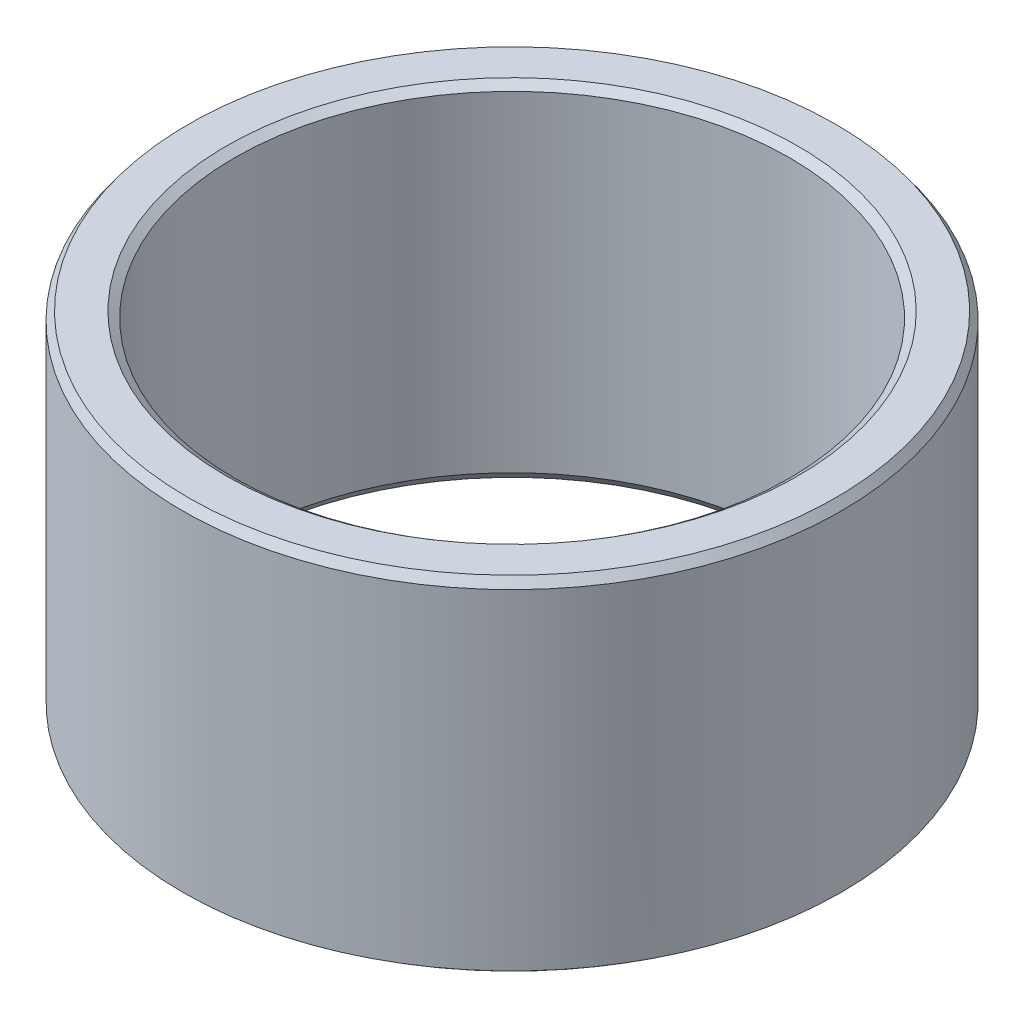
ISO-10303-21;
HEADER;
FILE_DESCRIPTION(('STEP AP214'),'2;1');
FILE_NAME('part.step','',(''),(''),'','','');
FILE_SCHEMA(('AUTOMOTIVE_DESIGN { 1 0 10303 214 1 1 1 1 }'));
ENDSEC;
DATA;
#1=APPLICATION_CONTEXT('core data for automotive mechanical design processes');
#2=APPLICATION_PROTOCOL_DEFINITION('international standard','automotive_design',2000,#1);
#3=PRODUCT_CONTEXT('',#1,'mechanical');
#4=PRODUCT('Part','Part','',(#3));
#5=PRODUCT_RELATED_PRODUCT_CATEGORY('part','',(#4));
#6=PRODUCT_DEFINITION_FORMATION('','',#4);
#7=PRODUCT_DEFINITION_CONTEXT('part definition',#1,'design');
#8=PRODUCT_DEFINITION('design','',#6,#7);
#9=PRODUCT_DEFINITION_SHAPE('','',#8);
#10=(LENGTH_UNIT() NAMED_UNIT(*) SI_UNIT(.MILLI.,.METRE.));
#11=(NAMED_UNIT(*) PLANE_ANGLE_UNIT() SI_UNIT($,.RADIAN.));
#12=(NAMED_UNIT(*) SI_UNIT($,.STERADIAN.) SOLID_ANGLE_UNIT());
#13=UNCERTAINTY_MEASURE_WITH_UNIT(LENGTH_MEASURE(1.E-05),#10,'distance_accuracy_value','');
#14=(GEOMETRIC_REPRESENTATION_CONTEXT(3) GLOBAL_UNCERTAINTY_ASSIGNED_CONTEXT((#13)) GLOBAL_UNIT_ASSIGNED_CONTEXT((#10,
#11,#12)) REPRESENTATION_CONTEXT('',''));
#15=CARTESIAN_POINT('',(0.,0.,0.));
#16=DIRECTION('',(0.,0.,1.));
#17=DIRECTION('',(1.,0.,0.));
#18=AXIS2_PLACEMENT_3D('',#15,#16,#17);
#19=CARTESIAN_POINT('',(0.,23.5215551141102,0.));
#20=DIRECTION('',(0.,-1.,0.));
#21=DIRECTION('',(0.,0.,-1.));
#22=AXIS2_PLACEMENT_3D('',#19,#20,#21);
#23=CYLINDRICAL_SURFACE('',#22,22.5);
#24=CARTESIAN_POINT('',(0.,0.409436889821459,0.));
#25=DIRECTION('',(0.,1.,0.));
#26=DIRECTION('',(0.,0.,1.));
#27=AXIS2_PLACEMENT_3D('',#24,#25,#26);
#28=CIRCLE('',#27,22.5);
#29=CARTESIAN_POINT('',(0.,0.409436889821455,-22.5));
#30=VERTEX_POINT('',#29);
#31=EDGE_CURVE('E10',#30,#30,#28,.T.);
#32=CARTESIAN_POINT('',(0.,22.956294201715,0.));
#33=DIRECTION('',(0.,1.,0.));
#34=DIRECTION('',(0.,0.,1.));
#35=AXIS2_PLACEMENT_3D('',#32,#33,#34);
#36=CIRCLE('',#35,22.5);
#37=CARTESIAN_POINT('',(0.,22.956294201715,-22.5));
#38=VERTEX_POINT('',#37);
#39=EDGE_CURVE('E50',#38,#38,#36,.F.);
#40=CARTESIAN_POINT('',(0.,0.409436889821455,-22.5));
#41=CARTESIAN_POINT('',(0.,0.644299986820346,-22.5));
#42=CARTESIAN_POINT('',(0.,0.879163083819237,-22.5));
#43=CARTESIAN_POINT('',(0.,1.34888927781702,-22.5));
#44=CARTESIAN_POINT('',(0.,1.58375237481591,-22.5));
#45=CARTESIAN_POINT('',(0.,2.0534785688137,-22.5));
#46=CARTESIAN_POINT('',(0.,2.28834166581259,-22.5));
#47=CARTESIAN_POINT('',(0.,2.75806785981037,-22.5));
#48=CARTESIAN_POINT('',(0.,2.99293095680926,-22.5));
#49=CARTESIAN_POINT('',(0.,3.46265715080705,-22.5));
#50=CARTESIAN_POINT('',(0.,3.69752024780594,-22.5));
#51=CARTESIAN_POINT('',(0.,4.16724644180372,-22.5));
#52=CARTESIAN_POINT('',(0.,4.40210953880261,-22.5));
#53=CARTESIAN_POINT('',(0.,4.8718357328004,-22.5));
#54=CARTESIAN_POINT('',(0.,5.10669882979929,-22.5));
#55=CARTESIAN_POINT('',(0.,5.57642502379707,-22.5));
#56=CARTESIAN_POINT('',(0.,5.81128812079596,-22.5));
#57=CARTESIAN_POINT('',(0.,6.28101431479375,-22.5));
#58=CARTESIAN_POINT('',(0.,6.51587741179264,-22.5));
#59=CARTESIAN_POINT('',(0.,6.98560360579042,-22.5));
#60=CARTESIAN_POINT('',(0.,7.22046670278931,-22.5));
#61=CARTESIAN_POINT('',(0.,7.69019289678709,-22.5));
#62=CARTESIAN_POINT('',(0.,7.92505599378599,-22.5));
#63=CARTESIAN_POINT('',(0.,8.39478218778377,-22.5));
#64=CARTESIAN_POINT('',(0.,8.62964528478266,-22.5));
#65=CARTESIAN_POINT('',(0.,9.09937147878044,-22.5));
#66=CARTESIAN_POINT('',(0.,9.33423457577933,-22.5));
#67=CARTESIAN_POINT('',(0.,9.80396076977712,-22.5));
#68=CARTESIAN_POINT('',(0.,10.038823866776,-22.5));
#69=CARTESIAN_POINT('',(0.,10.5085500607738,-22.5));
#70=CARTESIAN_POINT('',(0.,10.7434131577727,-22.5));
#71=CARTESIAN_POINT('',(0.,11.2131393517705,-22.5));
#72=CARTESIAN_POINT('',(0.,11.4480024487694,-22.5));
#73=CARTESIAN_POINT('',(0.,11.9177286427671,-22.5));
#74=CARTESIAN_POINT('',(0.,12.152591739766,-22.5));
#75=CARTESIAN_POINT('',(0.,12.6223179337638,-22.5));
#76=CARTESIAN_POINT('',(0.,12.8571810307627,-22.5));
#77=CARTESIAN_POINT('',(0.,13.3269072247605,-22.5));
#78=CARTESIAN_POINT('',(0.,13.5617703217594,-22.5));
#79=CARTESIAN_POINT('',(0.,14.0314965157572,-22.5));
#80=CARTESIAN_POINT('',(0.,14.2663596127561,-22.5));
#81=CARTESIAN_POINT('',(0.,14.7360858067538,-22.5));
#82=CARTESIAN_POINT('',(0.,14.9709489037527,-22.5));
#83=CARTESIAN_POINT('',(0.,15.4406750977505,-22.5));
#84=CARTESIAN_POINT('',(0.,15.6755381947494,-22.5));
#85=CARTESIAN_POINT('',(0.,16.1452643887472,-22.5));
#86=CARTESIAN_POINT('',(0.,16.3801274857461,-22.5));
#87=CARTESIAN_POINT('',(0.,16.8498536797439,-22.5));
#88=CARTESIAN_POINT('',(0.,17.0847167767428,-22.5));
#89=CARTESIAN_POINT('',(0.,17.5544429707405,-22.5));
#90=CARTESIAN_POINT('',(0.,17.7893060677394,-22.5));
#91=CARTESIAN_POINT('',(0.,18.2590322617372,-22.5));
#92=CARTESIAN_POINT('',(0.,18.4938953587361,-22.5));
#93=CARTESIAN_POINT('',(0.,18.9636215527339,-22.5));
#94=CARTESIAN_POINT('',(0.,19.1984846497328,-22.5));
#95=CARTESIAN_POINT('',(0.,19.6682108437306,-22.5));
#96=CARTESIAN_POINT('',(0.,19.9030739407295,-22.5));
#97=CARTESIAN_POINT('',(0.,20.3728001347272,-22.5));
#98=CARTESIAN_POINT('',(0.,20.6076632317261,-22.5));
#99=CARTESIAN_POINT('',(0.,21.0773894257239,-22.5));
#100=CARTESIAN_POINT('',(0.,21.3122525227228,-22.5));
#101=CARTESIAN_POINT('',(0.,21.7819787167206,-22.5));
#102=CARTESIAN_POINT('',(0.,22.0168418137195,-22.5));
#103=CARTESIAN_POINT('',(0.,22.4865680077173,-22.5));
#104=CARTESIAN_POINT('',(0.,22.7214311047162,-22.5));
#105=CARTESIAN_POINT('',(0.,22.956294201715,-22.5));
#106=B_SPLINE_CURVE_WITH_KNOTS('',3,(#40,#41,#42,#43,#44,#45,#46,#47,#48,#49,#50,#51,#52,#53,
#54,#55,#56,#57,#58,#59,#60,#61,#62,#63,#64,#65,#66,#67,#68,#69,#70,#71,#72,#73,#74,#75,#76,#77,
#78,#79,#80,#81,#82,#83,#84,#85,#86,#87,#88,#89,#90,#91,#92,#93,#94,#95,#96,#97,#98,#99,#100,
#101,#102,#103,#104,#105),.UNSPECIFIED.,.F.,.F.,(4,2,2,2,2,2,2,2,2,2,2,2,2,2,2,2,2,2,2,2,2,2,2,
2,2,2,2,2,2,2,2,2,4),(0.,0.704589290996673,1.40917858199335,2.11376787299002,2.8183571639867,
3.52294645498337,4.22753574598005,4.93212503697672,5.6367143279734,6.34130361897007,
7.04589290996675,7.75048220096342,8.4550714919601,9.15966078295677,9.86425007395345,
10.5688393649501,11.2734286559468,11.9780179469435,12.6826072379401,13.3871965289368,
14.0917858199335,14.7963751109302,15.5009644019268,16.2055536929235,16.9101429839202,
17.6147322749169,18.3193215659135,19.0239108569102,19.7285001479069,20.4330894389036,
21.1376787299002,21.8422680208969,22.5468573118936),.UNSPECIFIED.);
#107=EDGE_CURVE('BSEAM39',#30,#38,#106,.T.);
#108=ORIENTED_EDGE('',*,*,#31,.T.);
#109=ORIENTED_EDGE('',*,*,#39,.T.);
#110=ORIENTED_EDGE('',*,*,#107,.T.);
#111=ORIENTED_EDGE('',*,*,#107,.F.);
#112=EDGE_LOOP('',(#108,#110,#109,#111));
#113=FACE_BOUND('',#112,.T.);
#114=ADVANCED_FACE('F39',(#113),#23,.T.);
#115=CARTESIAN_POINT('',(0.,23.5215551141102,0.));
#116=DIRECTION('',(0.,1.,0.));
#117=DIRECTION('',(0.,0.,1.));
#118=AXIS2_PLACEMENT_3D('',#115,#116,#117);
#119=PLANE('',#118);
#120=CARTESIAN_POINT('',(0.,23.5215551141102,0.));
#121=DIRECTION('',(0.,1.,0.));
#122=DIRECTION('',(0.,0.,1.));
#123=AXIS2_PLACEMENT_3D('',#120,#121,#122);
#124=CIRCLE('',#123,19.5113761215568);
#125=CARTESIAN_POINT('',(0.,23.5215551141102,19.5113761215568));
#126=VERTEX_POINT('',#125);
#127=EDGE_CURVE('E58',#126,#126,#124,.F.);
#128=ORIENTED_EDGE('',*,*,#127,.T.);
#129=EDGE_LOOP('',(#128));
#130=FACE_BOUND('',#129,.T.);
#131=CARTESIAN_POINT('',(0.,23.5215551141102,0.));
#132=DIRECTION('',(0.,1.,0.));
#133=DIRECTION('',(0.,0.,1.));
#134=AXIS2_PLACEMENT_3D('',#131,#132,#133);
#135=CIRCLE('',#134,22.0905631101786);
#136=CARTESIAN_POINT('',(0.,23.5215551141102,22.0905631101786));
#137=VERTEX_POINT('',#136);
#138=EDGE_CURVE('E61',#137,#137,#135,.T.);
#139=ORIENTED_EDGE('',*,*,#138,.T.);
#140=EDGE_LOOP('',(#139));
#141=FACE_BOUND('',#140,.T.);
#142=ADVANCED_FACE('F88',(#130,#141),#119,.T.);
#143=CARTESIAN_POINT('',(0.,0.,0.));
#144=DIRECTION('',(0.,1.,0.));
#145=DIRECTION('',(0.,0.,1.));
#146=AXIS2_PLACEMENT_3D('',#143,#144,#145);
#147=PLANE('',#146);
#148=CARTESIAN_POINT('',(0.,0.,0.));
#149=DIRECTION('',(0.,1.,0.));
#150=DIRECTION('',(0.,0.,1.));
#151=AXIS2_PLACEMENT_3D('',#148,#149,#150);
#152=CIRCLE('',#151,19.355552098983);
#153=CARTESIAN_POINT('',(0.,0.,19.355552098983));
#154=VERTEX_POINT('',#153);
#155=EDGE_CURVE('E51',#154,#154,#152,.T.);
#156=ORIENTED_EDGE('',*,*,#155,.T.);
#157=EDGE_LOOP('',(#156));
#158=FACE_BOUND('',#157,.T.);
#159=CARTESIAN_POINT('',(0.,0.,0.));
#160=DIRECTION('',(0.,1.,0.));
#161=DIRECTION('',(0.,0.,1.));
#162=AXIS2_PLACEMENT_3D('',#159,#160,#161);
#163=CIRCLE('',#162,21.9347390876048);
#164=CARTESIAN_POINT('',(0.,0.,21.9347390876048));
#165=VERTEX_POINT('',#164);
#166=EDGE_CURVE('E54',#165,#165,#163,.F.);
#167=ORIENTED_EDGE('',*,*,#166,.T.);
#168=EDGE_LOOP('',(#167));
#169=FACE_BOUND('',#168,.T.);
#170=ADVANCED_FACE('F83',(#158,#169),#147,.F.);
#171=CARTESIAN_POINT('',(0.,23.5215551141102,0.));
#172=DIRECTION('',(0.,-1.,0.));
#173=DIRECTION('',(0.,0.,-1.));
#174=AXIS2_PLACEMENT_3D('',#171,#172,#173);
#175=CYLINDRICAL_SURFACE('',#174,18.9461152091616);
#176=CARTESIAN_POINT('',(0.,23.1121182242887,0.));
#177=DIRECTION('',(0.,1.,0.));
#178=DIRECTION('',(0.,0.,1.));
#179=AXIS2_PLACEMENT_3D('',#176,#177,#178);
#180=CIRCLE('',#179,18.9461152091616);
#181=CARTESIAN_POINT('',(0.,23.1121182242887,-18.9461152091616));
#182=VERTEX_POINT('',#181);
#183=EDGE_CURVE('E67',#182,#182,#180,.T.);
#184=CARTESIAN_POINT('',(0.,0.565260912395137,0.));
#185=DIRECTION('',(0.,1.,0.));
#186=DIRECTION('',(0.,0.,1.));
#187=AXIS2_PLACEMENT_3D('',#184,#185,#186);
#188=CIRCLE('',#187,18.9461152091616);
#189=CARTESIAN_POINT('',(0.,0.565260912395133,-18.9461152091616));
#190=VERTEX_POINT('',#189);
#191=EDGE_CURVE('E69',#190,#190,#188,.F.);
#192=CARTESIAN_POINT('',(0.,23.1121182242887,-18.9461152091616));
#193=CARTESIAN_POINT('',(0.,22.8772551272898,-18.9461152091616));
#194=CARTESIAN_POINT('',(0.,22.6423920302909,-18.9461152091616));
#195=CARTESIAN_POINT('',(0.,22.1726658362931,-18.9461152091616));
#196=CARTESIAN_POINT('',(0.,21.9378027392943,-18.9461152091616));
#197=CARTESIAN_POINT('',(0.,21.4680765452965,-18.9461152091616));
#198=CARTESIAN_POINT('',(0.,21.2332134482976,-18.9461152091616));
#199=CARTESIAN_POINT('',(0.,20.7634872542998,-18.9461152091616));
#200=CARTESIAN_POINT('',(0.,20.5286241573009,-18.9461152091616));
#201=CARTESIAN_POINT('',(0.,20.0588979633031,-18.9461152091616));
#202=CARTESIAN_POINT('',(0.,19.8240348663042,-18.9461152091616));
#203=CARTESIAN_POINT('',(0.,19.3543086723065,-18.9461152091616));
#204=CARTESIAN_POINT('',(0.,19.1194455753076,-18.9461152091616));
#205=CARTESIAN_POINT('',(0.,18.6497193813098,-18.9461152091616));
#206=CARTESIAN_POINT('',(0.,18.4148562843109,-18.9461152091616));
#207=CARTESIAN_POINT('',(0.,17.9451300903131,-18.9461152091616));
#208=CARTESIAN_POINT('',(0.,17.7102669933142,-18.9461152091616));
#209=CARTESIAN_POINT('',(0.,17.2405407993164,-18.9461152091616));
#210=CARTESIAN_POINT('',(0.,17.0056777023175,-18.9461152091616));
#211=CARTESIAN_POINT('',(0.,16.5359515083198,-18.9461152091616));
#212=CARTESIAN_POINT('',(0.,16.3010884113209,-18.9461152091616));
#213=CARTESIAN_POINT('',(0.,15.8313622173231,-18.9461152091616));
#214=CARTESIAN_POINT('',(0.,15.5964991203242,-18.9461152091616));
#215=CARTESIAN_POINT('',(0.,15.1267729263264,-18.9461152091616));
#216=CARTESIAN_POINT('',(0.,14.8919098293275,-18.9461152091616));
#217=CARTESIAN_POINT('',(0.,14.4221836353297,-18.9461152091616));
#218=CARTESIAN_POINT('',(0.,14.1873205383308,-18.9461152091616));
#219=CARTESIAN_POINT('',(0.,13.7175943443331,-18.9461152091616));
#220=CARTESIAN_POINT('',(0.,13.4827312473342,-18.9461152091616));
#221=CARTESIAN_POINT('',(0.,13.0130050533364,-18.9461152091616));
#222=CARTESIAN_POINT('',(0.,12.7781419563375,-18.9461152091616));
#223=CARTESIAN_POINT('',(0.,12.3084157623397,-18.9461152091616));
#224=CARTESIAN_POINT('',(0.,12.0735526653408,-18.9461152091616));
#225=CARTESIAN_POINT('',(0.,11.603826471343,-18.9461152091616));
#226=CARTESIAN_POINT('',(0.,11.3689633743441,-18.9461152091616));
#227=CARTESIAN_POINT('',(0.,10.8992371803464,-18.9461152091616));
#228=CARTESIAN_POINT('',(0.,10.6643740833475,-18.9461152091616));
#229=CARTESIAN_POINT('',(0.,10.1946478893497,-18.9461152091616));
#230=CARTESIAN_POINT('',(0.,9.95978479235079,-18.9461152091616));
#231=CARTESIAN_POINT('',(0.,9.49005859835301,-18.9461152091616));
#232=CARTESIAN_POINT('',(0.,9.25519550135412,-18.9461152091616));
#233=CARTESIAN_POINT('',(0.,8.78546930735633,-18.9461152091616));
#234=CARTESIAN_POINT('',(0.,8.55060621035744,-18.9461152091616));
#235=CARTESIAN_POINT('',(0.,8.08088001635966,-18.9461152091616));
#236=CARTESIAN_POINT('',(0.,7.84601691936077,-18.9461152091616));
#237=CARTESIAN_POINT('',(0.,7.37629072536299,-18.9461152091616));
#238=CARTESIAN_POINT('',(0.,7.1414276283641,-18.9461152091616));
#239=CARTESIAN_POINT('',(0.,6.67170143436631,-18.9461152091616));
#240=CARTESIAN_POINT('',(0.,6.43683833736742,-18.9461152091616));
#241=CARTESIAN_POINT('',(0.,5.96711214336964,-18.9461152091616));
#242=CARTESIAN_POINT('',(0.,5.73224904637074,-18.9461152091616));
#243=CARTESIAN_POINT('',(0.,5.26252285237296,-18.9461152091616));
#244=CARTESIAN_POINT('',(0.,5.02765975537407,-18.9461152091616));
#245=CARTESIAN_POINT('',(0.,4.55793356137629,-18.9461152091616));
#246=CARTESIAN_POINT('',(0.,4.3230704643774,-18.9461152091616));
#247=CARTESIAN_POINT('',(0.,3.85334427037961,-18.9461152091616));
#248=CARTESIAN_POINT('',(0.,3.61848117338072,-18.9461152091616));
#249=CARTESIAN_POINT('',(0.,3.14875497938294,-18.9461152091616));
#250=CARTESIAN_POINT('',(0.,2.91389188238405,-18.9461152091616));
#251=CARTESIAN_POINT('',(0.,2.44416568838626,-18.9461152091616));
#252=CARTESIAN_POINT('',(0.,2.20930259138737,-18.9461152091616));
#253=CARTESIAN_POINT('',(0.,1.73957639738959,-18.9461152091616));
#254=CARTESIAN_POINT('',(0.,1.5047133003907,-18.9461152091616));
#255=CARTESIAN_POINT('',(0.,1.03498710639292,-18.9461152091616));
#256=CARTESIAN_POINT('',(0.,0.800124009394024,-18.9461152091616));
#257=CARTESIAN_POINT('',(0.,0.565260912395133,-18.9461152091616));
#258=B_SPLINE_CURVE_WITH_KNOTS('',3,(#192,#193,#194,#195,#196,#197,#198,#199,#200,#201,#202,
#203,#204,#205,#206,#207,#208,#209,#210,#211,#212,#213,#214,#215,#216,#217,#218,#219,#220,#221,
#222,#223,#224,#225,#226,#227,#228,#229,#230,#231,#232,#233,#234,#235,#236,#237,#238,#239,#240,
#241,#242,#243,#244,#245,#246,#247,#248,#249,#250,#251,#252,#253,#254,#255,#256,#257),
.UNSPECIFIED.,.F.,.F.,(4,2,2,2,2,2,2,2,2,2,2,2,2,2,2,2,2,2,2,2,2,2,2,2,2,2,2,2,2,2,2,2,4),(0.,
0.704589290996673,1.40917858199335,2.11376787299002,2.8183571639867,3.52294645498337,
4.22753574598004,4.93212503697672,5.63671432797339,6.34130361897007,7.04589290996674,
7.75048220096342,8.45507149196009,9.15966078295676,9.86425007395344,10.5688393649501,
11.2734286559468,11.9780179469435,12.6826072379401,13.3871965289368,14.0917858199335,
14.7963751109302,15.5009644019268,16.2055536929235,16.9101429839202,17.6147322749169,
18.3193215659135,19.0239108569102,19.7285001479069,20.4330894389036,21.1376787299002,
21.8422680208969,22.5468573118936),.UNSPECIFIED.);
#259=EDGE_CURVE('BSEAM71',#182,#190,#258,.T.);
#260=ORIENTED_EDGE('',*,*,#183,.T.);
#261=ORIENTED_EDGE('',*,*,#191,.T.);
#262=ORIENTED_EDGE('',*,*,#259,.T.);
#263=ORIENTED_EDGE('',*,*,#259,.F.);
#264=EDGE_LOOP('',(#260,#262,#261,#263));
#265=FACE_BOUND('',#264,.T.);
#266=ADVANCED_FACE('F71',(#265),#175,.F.);
#267=CARTESIAN_POINT('',(0.,23.1121182242887,0.));
#268=DIRECTION('',(0.,1.,0.));
#269=DIRECTION('',(0.,0.,1.));
#270=AXIS2_PLACEMENT_3D('',#267,#268,#269);
#271=CONICAL_SURFACE('',#270,18.9461152091616,0.943925752519383);
#272=ORIENTED_EDGE('',*,*,#127,.F.);
#273=EDGE_LOOP('',(#272));
#274=FACE_BOUND('',#273,.T.);
#275=ORIENTED_EDGE('',*,*,#183,.F.);
#276=EDGE_LOOP('',(#275));
#277=FACE_BOUND('',#276,.T.);
#278=ADVANCED_FACE('F77',(#274,#277),#271,.F.);
#279=CARTESIAN_POINT('',(0.,0.,0.));
#280=DIRECTION('',(0.,-1.,0.));
#281=DIRECTION('',(0.,0.,-1.));
#282=AXIS2_PLACEMENT_3D('',#279,#280,#281);
#283=CONICAL_SURFACE('',#282,19.355552098983,0.626870574275522);
#284=ORIENTED_EDGE('',*,*,#191,.F.);
#285=EDGE_LOOP('',(#284));
#286=FACE_BOUND('',#285,.T.);
#287=ORIENTED_EDGE('',*,*,#155,.F.);
#288=EDGE_LOOP('',(#287));
#289=FACE_BOUND('',#288,.T.);
#290=ADVANCED_FACE('F73',(#286,#289),#283,.F.);
#291=CARTESIAN_POINT('',(0.,0.409436889821459,0.));
#292=DIRECTION('',(0.,1.,0.));
#293=DIRECTION('',(0.,0.,1.));
#294=AXIS2_PLACEMENT_3D('',#291,#292,#293);
#295=CONICAL_SURFACE('',#294,22.5,0.943925752519366);
#296=ORIENTED_EDGE('',*,*,#166,.F.);
#297=EDGE_LOOP('',(#296));
#298=FACE_BOUND('',#297,.T.);
#299=ORIENTED_EDGE('',*,*,#31,.F.);
#300=EDGE_LOOP('',(#299));
#301=FACE_BOUND('',#300,.T.);
#302=ADVANCED_FACE('F76',(#298,#301),#295,.T.);
#303=CARTESIAN_POINT('',(0.,23.5215551141102,0.));
#304=DIRECTION('',(0.,-1.,0.));
#305=DIRECTION('',(0.,0.,-1.));
#306=AXIS2_PLACEMENT_3D('',#303,#304,#305);
#307=CONICAL_SURFACE('',#306,22.0905631101786,0.626870574275528);
#308=ORIENTED_EDGE('',*,*,#39,.F.);
#309=EDGE_LOOP('',(#308));
#310=FACE_BOUND('',#309,.T.);
#311=ORIENTED_EDGE('',*,*,#138,.F.);
#312=EDGE_LOOP('',(#311));
#313=FACE_BOUND('',#312,.T.);
#314=ADVANCED_FACE('F45',(#310,#313),#307,.T.);
#315=CLOSED_SHELL('',(#114,#142,#170,#266,#278,#290,#302,#314));
#316=MANIFOLD_SOLID_BREP('B2',#315);
#317=ADVANCED_BREP_SHAPE_REPRESENTATION('',(#18,#316),#14);
#318=SHAPE_DEFINITION_REPRESENTATION(#9,#317);
ENDSEC;
END-ISO-10303-21;
